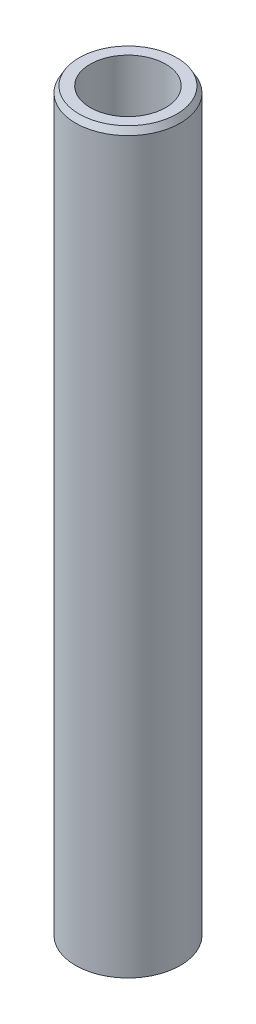
ISO-10303-21;
HEADER;
FILE_DESCRIPTION(('STEP AP214'),'2;1');
FILE_NAME('part.step','',(''),(''),'','','');
FILE_SCHEMA(('AUTOMOTIVE_DESIGN { 1 0 10303 214 1 1 1 1 }'));
ENDSEC;
DATA;
#1=APPLICATION_CONTEXT('core data for automotive mechanical design processes');
#2=APPLICATION_PROTOCOL_DEFINITION('international standard','automotive_design',2000,#1);
#3=PRODUCT_CONTEXT('',#1,'mechanical');
#4=PRODUCT('Part','Part','',(#3));
#5=PRODUCT_RELATED_PRODUCT_CATEGORY('part','',(#4));
#6=PRODUCT_DEFINITION_FORMATION('','',#4);
#7=PRODUCT_DEFINITION_CONTEXT('part definition',#1,'design');
#8=PRODUCT_DEFINITION('design','',#6,#7);
#9=PRODUCT_DEFINITION_SHAPE('','',#8);
#10=(LENGTH_UNIT() NAMED_UNIT(*) SI_UNIT(.MILLI.,.METRE.));
#11=(NAMED_UNIT(*) PLANE_ANGLE_UNIT() SI_UNIT($,.RADIAN.));
#12=(NAMED_UNIT(*) SI_UNIT($,.STERADIAN.) SOLID_ANGLE_UNIT());
#13=UNCERTAINTY_MEASURE_WITH_UNIT(LENGTH_MEASURE(1.E-05),#10,'distance_accuracy_value','');
#14=(GEOMETRIC_REPRESENTATION_CONTEXT(3) GLOBAL_UNCERTAINTY_ASSIGNED_CONTEXT((#13)) GLOBAL_UNIT_ASSIGNED_CONTEXT((#10,
#11,#12)) REPRESENTATION_CONTEXT('',''));
#15=CARTESIAN_POINT('',(0.,0.,0.));
#16=DIRECTION('',(0.,0.,1.));
#17=DIRECTION('',(1.,0.,0.));
#18=AXIS2_PLACEMENT_3D('',#15,#16,#17);
#19=CARTESIAN_POINT('',(0.,600.,0.));
#20=DIRECTION('',(0.,-1.,0.));
#21=DIRECTION('',(0.,0.,-1.));
#22=AXIS2_PLACEMENT_3D('',#19,#20,#21);
#23=CYLINDRICAL_SURFACE('',#22,42.5);
#24=CARTESIAN_POINT('',(0.,595.038099124089,0.));
#25=DIRECTION('',(0.,1.,0.));
#26=DIRECTION('',(0.,0.,1.));
#27=AXIS2_PLACEMENT_3D('',#24,#25,#26);
#28=CIRCLE('',#27,42.5);
#29=CARTESIAN_POINT('',(0.,595.038099124089,42.5));
#30=VERTEX_POINT('',#29);
#31=EDGE_CURVE('E50',#30,#30,#28,.F.);
#32=ORIENTED_EDGE('',*,*,#31,.T.);
#33=EDGE_LOOP('',(#32));
#34=FACE_BOUND('',#33,.T.);
#35=CARTESIAN_POINT('',(0.,2.86475480639947,0.));
#36=DIRECTION('',(0.,1.,0.));
#37=DIRECTION('',(0.,0.,1.));
#38=AXIS2_PLACEMENT_3D('',#35,#36,#37);
#39=CIRCLE('',#38,42.5);
#40=CARTESIAN_POINT('',(0.,2.86475480639947,42.5));
#41=VERTEX_POINT('',#40);
#42=EDGE_CURVE('E51',#41,#41,#39,.T.);
#43=ORIENTED_EDGE('',*,*,#42,.T.);
#44=EDGE_LOOP('',(#43));
#45=FACE_BOUND('',#44,.T.);
#46=ADVANCED_FACE('F39',(#34,#45),#23,.T.);
#47=CARTESIAN_POINT('',(0.,600.,0.));
#48=DIRECTION('',(0.,1.,0.));
#49=DIRECTION('',(0.,0.,1.));
#50=AXIS2_PLACEMENT_3D('',#47,#48,#49);
#51=PLANE('',#50);
#52=CARTESIAN_POINT('',(0.,600.,0.));
#53=DIRECTION('',(0.,1.,0.));
#54=DIRECTION('',(0.,0.,1.));
#55=AXIS2_PLACEMENT_3D('',#52,#53,#54);
#56=CIRCLE('',#55,39.6352451936004);
#57=CARTESIAN_POINT('',(0.,600.,39.6352451936004));
#58=VERTEX_POINT('',#57);
#59=EDGE_CURVE('E54',#58,#58,#56,.T.);
#60=ORIENTED_EDGE('',*,*,#59,.T.);
#61=EDGE_LOOP('',(#60));
#62=FACE_BOUND('',#61,.T.);
#63=CARTESIAN_POINT('',(0.,600.,0.));
#64=DIRECTION('',(0.,1.,0.));
#65=DIRECTION('',(0.,0.,1.));
#66=AXIS2_PLACEMENT_3D('',#63,#64,#65);
#67=CIRCLE('',#66,30.605687073998);
#68=CARTESIAN_POINT('',(0.,600.,30.605687073998));
#69=VERTEX_POINT('',#68);
#70=EDGE_CURVE('E58',#69,#69,#67,.T.);
#71=ORIENTED_EDGE('',*,*,#70,.F.);
#72=EDGE_LOOP('',(#71));
#73=FACE_BOUND('',#72,.T.);
#74=ADVANCED_FACE('F69',(#62,#73),#51,.T.);
#75=CARTESIAN_POINT('',(0.,0.,0.));
#76=DIRECTION('',(0.,1.,0.));
#77=DIRECTION('',(0.,0.,1.));
#78=AXIS2_PLACEMENT_3D('',#75,#76,#77);
#79=PLANE('',#78);
#80=CARTESIAN_POINT('',(0.,0.,0.));
#81=DIRECTION('',(0.,1.,0.));
#82=DIRECTION('',(0.,0.,1.));
#83=AXIS2_PLACEMENT_3D('',#80,#81,#82);
#84=CIRCLE('',#83,37.538099124089);
#85=CARTESIAN_POINT('',(0.,0.,37.538099124089));
#86=VERTEX_POINT('',#85);
#87=EDGE_CURVE('E10',#86,#86,#84,.F.);
#88=ORIENTED_EDGE('',*,*,#87,.T.);
#89=EDGE_LOOP('',(#88));
#90=FACE_BOUND('',#89,.T.);
#91=CARTESIAN_POINT('',(0.,0.,0.));
#92=DIRECTION('',(0.,1.,0.));
#93=DIRECTION('',(0.,0.,1.));
#94=AXIS2_PLACEMENT_3D('',#91,#92,#93);
#95=CIRCLE('',#94,30.605687073998);
#96=CARTESIAN_POINT('',(0.,0.,30.605687073998));
#97=VERTEX_POINT('',#96);
#98=EDGE_CURVE('E63',#97,#97,#95,.T.);
#99=ORIENTED_EDGE('',*,*,#98,.T.);
#100=EDGE_LOOP('',(#99));
#101=FACE_BOUND('',#100,.T.);
#102=ADVANCED_FACE('F75',(#90,#101),#79,.F.);
#103=CARTESIAN_POINT('',(0.,600.,0.));
#104=DIRECTION('',(0.,-1.,0.));
#105=DIRECTION('',(0.,0.,-1.));
#106=AXIS2_PLACEMENT_3D('',#103,#104,#105);
#107=CYLINDRICAL_SURFACE('',#106,30.605687073998);
#108=ORIENTED_EDGE('',*,*,#70,.T.);
#109=EDGE_LOOP('',(#108));
#110=FACE_BOUND('',#109,.T.);
#111=ORIENTED_EDGE('',*,*,#98,.F.);
#112=EDGE_LOOP('',(#111));
#113=FACE_BOUND('',#112,.T.);
#114=ADVANCED_FACE('F70',(#110,#113),#107,.F.);
#115=CARTESIAN_POINT('',(0.,600.,0.));
#116=DIRECTION('',(0.,-1.,0.));
#117=DIRECTION('',(0.,0.,-1.));
#118=AXIS2_PLACEMENT_3D('',#115,#116,#117);
#119=CONICAL_SURFACE('',#118,39.6352451936004,0.523598775598295);
#120=ORIENTED_EDGE('',*,*,#31,.F.);
#121=EDGE_LOOP('',(#120));
#122=FACE_BOUND('',#121,.T.);
#123=ORIENTED_EDGE('',*,*,#59,.F.);
#124=EDGE_LOOP('',(#123));
#125=FACE_BOUND('',#124,.T.);
#126=ADVANCED_FACE('F81',(#122,#125),#119,.T.);
#127=CARTESIAN_POINT('',(0.,2.86475480639947,0.));
#128=DIRECTION('',(0.,1.,0.));
#129=DIRECTION('',(0.,0.,1.));
#130=AXIS2_PLACEMENT_3D('',#127,#128,#129);
#131=CONICAL_SURFACE('',#130,42.5,1.0471975511966);
#132=ORIENTED_EDGE('',*,*,#87,.F.);
#133=EDGE_LOOP('',(#132));
#134=FACE_BOUND('',#133,.T.);
#135=ORIENTED_EDGE('',*,*,#42,.F.);
#136=EDGE_LOOP('',(#135));
#137=FACE_BOUND('',#136,.T.);
#138=ADVANCED_FACE('F45',(#134,#137),#131,.T.);
#139=CLOSED_SHELL('',(#46,#74,#102,#114,#126,#138));
#140=MANIFOLD_SOLID_BREP('B2',#139);
#141=ADVANCED_BREP_SHAPE_REPRESENTATION('',(#18,#140),#14);
#142=SHAPE_DEFINITION_REPRESENTATION(#9,#141);
ENDSEC;
END-ISO-10303-21;
